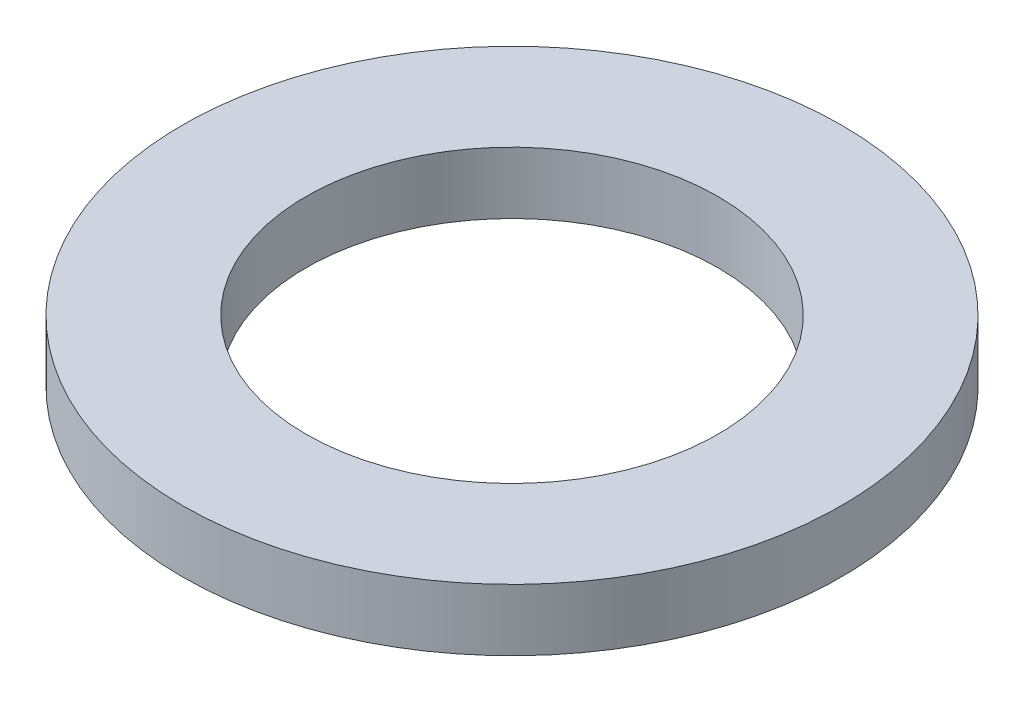
ISO-10303-21;
HEADER;
FILE_DESCRIPTION(('STEP AP214'),'2;1');
FILE_NAME('part.step','',(''),(''),'','','');
FILE_SCHEMA(('AUTOMOTIVE_DESIGN { 1 0 10303 214 1 1 1 1 }'));
ENDSEC;
DATA;
#1=APPLICATION_CONTEXT('core data for automotive mechanical design processes');
#2=APPLICATION_PROTOCOL_DEFINITION('international standard','automotive_design',2000,#1);
#3=PRODUCT_CONTEXT('',#1,'mechanical');
#4=PRODUCT('Part','Part','',(#3));
#5=PRODUCT_RELATED_PRODUCT_CATEGORY('part','',(#4));
#6=PRODUCT_DEFINITION_FORMATION('','',#4);
#7=PRODUCT_DEFINITION_CONTEXT('part definition',#1,'design');
#8=PRODUCT_DEFINITION('design','',#6,#7);
#9=PRODUCT_DEFINITION_SHAPE('','',#8);
#10=(LENGTH_UNIT() NAMED_UNIT(*) SI_UNIT(.MILLI.,.METRE.));
#11=(NAMED_UNIT(*) PLANE_ANGLE_UNIT() SI_UNIT($,.RADIAN.));
#12=(NAMED_UNIT(*) SI_UNIT($,.STERADIAN.) SOLID_ANGLE_UNIT());
#13=UNCERTAINTY_MEASURE_WITH_UNIT(LENGTH_MEASURE(1.E-05),#10,'distance_accuracy_value','');
#14=(GEOMETRIC_REPRESENTATION_CONTEXT(3) GLOBAL_UNCERTAINTY_ASSIGNED_CONTEXT((#13)) GLOBAL_UNIT_ASSIGNED_CONTEXT((#10,
#11,#12)) REPRESENTATION_CONTEXT('',''));
#15=CARTESIAN_POINT('',(0.,0.,0.));
#16=DIRECTION('',(0.,0.,1.));
#17=DIRECTION('',(1.,0.,0.));
#18=AXIS2_PLACEMENT_3D('',#15,#16,#17);
#19=CARTESIAN_POINT('',(0.,15.,0.));
#20=DIRECTION('',(0.,-1.,0.));
#21=DIRECTION('',(0.,0.,-1.));
#22=AXIS2_PLACEMENT_3D('',#19,#20,#21);
#23=CYLINDRICAL_SURFACE('',#22,80.);
#24=CARTESIAN_POINT('',(0.,15.,0.));
#25=DIRECTION('',(0.,1.,0.));
#26=DIRECTION('',(0.,0.,1.));
#27=AXIS2_PLACEMENT_3D('',#24,#25,#26);
#28=CIRCLE('',#27,80.);
#29=CARTESIAN_POINT('',(0.,15.,80.));
#30=VERTEX_POINT('',#29);
#31=EDGE_CURVE('E10',#30,#30,#28,.T.);
#32=ORIENTED_EDGE('',*,*,#31,.F.);
#33=EDGE_LOOP('',(#32));
#34=FACE_BOUND('',#33,.T.);
#35=CARTESIAN_POINT('',(0.,0.,0.));
#36=DIRECTION('',(0.,1.,0.));
#37=DIRECTION('',(0.,0.,1.));
#38=AXIS2_PLACEMENT_3D('',#35,#36,#37);
#39=CIRCLE('',#38,80.);
#40=CARTESIAN_POINT('',(0.,0.,80.));
#41=VERTEX_POINT('',#40);
#42=EDGE_CURVE('E37',#41,#41,#39,.T.);
#43=ORIENTED_EDGE('',*,*,#42,.T.);
#44=EDGE_LOOP('',(#43));
#45=FACE_BOUND('',#44,.T.);
#46=ADVANCED_FACE('F40',(#34,#45),#23,.T.);
#47=CARTESIAN_POINT('',(0.,15.,0.));
#48=DIRECTION('',(0.,1.,0.));
#49=DIRECTION('',(0.,0.,1.));
#50=AXIS2_PLACEMENT_3D('',#47,#48,#49);
#51=PLANE('',#50);
#52=CARTESIAN_POINT('',(0.,15.,0.));
#53=DIRECTION('',(0.,1.,0.));
#54=DIRECTION('',(0.,0.,1.));
#55=AXIS2_PLACEMENT_3D('',#52,#53,#54);
#56=CIRCLE('',#55,50.);
#57=CARTESIAN_POINT('',(0.,15.,50.));
#58=VERTEX_POINT('',#57);
#59=EDGE_CURVE('E50',#58,#58,#56,.T.);
#60=ORIENTED_EDGE('',*,*,#59,.F.);
#61=EDGE_LOOP('',(#60));
#62=FACE_BOUND('',#61,.T.);
#63=ORIENTED_EDGE('',*,*,#31,.T.);
#64=EDGE_LOOP('',(#63));
#65=FACE_BOUND('',#64,.T.);
#66=ADVANCED_FACE('F59',(#62,#65),#51,.T.);
#67=CARTESIAN_POINT('',(0.,0.,0.));
#68=DIRECTION('',(0.,1.,0.));
#69=DIRECTION('',(0.,0.,1.));
#70=AXIS2_PLACEMENT_3D('',#67,#68,#69);
#71=PLANE('',#70);
#72=CARTESIAN_POINT('',(0.,0.,0.));
#73=DIRECTION('',(0.,1.,0.));
#74=DIRECTION('',(0.,0.,1.));
#75=AXIS2_PLACEMENT_3D('',#72,#73,#74);
#76=CIRCLE('',#75,50.);
#77=CARTESIAN_POINT('',(0.,0.,50.));
#78=VERTEX_POINT('',#77);
#79=EDGE_CURVE('E47',#78,#78,#76,.T.);
#80=ORIENTED_EDGE('',*,*,#79,.T.);
#81=EDGE_LOOP('',(#80));
#82=FACE_BOUND('',#81,.T.);
#83=ORIENTED_EDGE('',*,*,#42,.F.);
#84=EDGE_LOOP('',(#83));
#85=FACE_BOUND('',#84,.T.);
#86=ADVANCED_FACE('F58',(#82,#85),#71,.F.);
#87=CARTESIAN_POINT('',(0.,15.,0.));
#88=DIRECTION('',(0.,-1.,0.));
#89=DIRECTION('',(0.,0.,-1.));
#90=AXIS2_PLACEMENT_3D('',#87,#88,#89);
#91=CYLINDRICAL_SURFACE('',#90,50.);
#92=ORIENTED_EDGE('',*,*,#59,.T.);
#93=EDGE_LOOP('',(#92));
#94=FACE_BOUND('',#93,.T.);
#95=ORIENTED_EDGE('',*,*,#79,.F.);
#96=EDGE_LOOP('',(#95));
#97=FACE_BOUND('',#96,.T.);
#98=ADVANCED_FACE('F54',(#94,#97),#91,.F.);
#99=CLOSED_SHELL('',(#46,#66,#86,#98));
#100=MANIFOLD_SOLID_BREP('B2',#99);
#101=ADVANCED_BREP_SHAPE_REPRESENTATION('',(#18,#100),#14);
#102=SHAPE_DEFINITION_REPRESENTATION(#9,#101);
ENDSEC;
END-ISO-10303-21;
